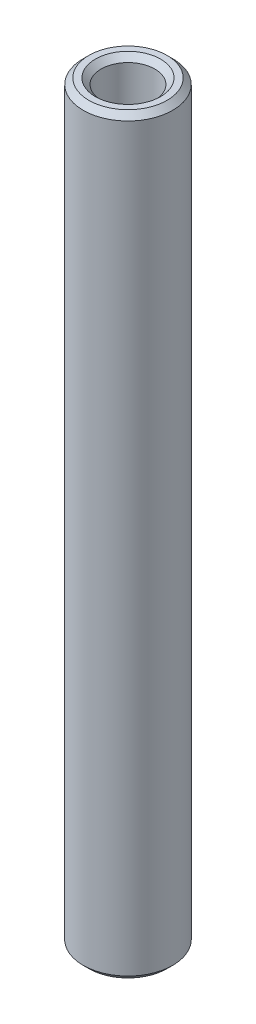
ISO-10303-21;
HEADER;
FILE_DESCRIPTION(('STEP AP214'),'2;1');
FILE_NAME('part.step','',(''),(''),'','','');
FILE_SCHEMA(('AUTOMOTIVE_DESIGN { 1 0 10303 214 1 1 1 1 }'));
ENDSEC;
DATA;
#1=APPLICATION_CONTEXT('core data for automotive mechanical design processes');
#2=APPLICATION_PROTOCOL_DEFINITION('international standard','automotive_design',2000,#1);
#3=PRODUCT_CONTEXT('',#1,'mechanical');
#4=PRODUCT('Part','Part','',(#3));
#5=PRODUCT_RELATED_PRODUCT_CATEGORY('part','',(#4));
#6=PRODUCT_DEFINITION_FORMATION('','',#4);
#7=PRODUCT_DEFINITION_CONTEXT('part definition',#1,'design');
#8=PRODUCT_DEFINITION('design','',#6,#7);
#9=PRODUCT_DEFINITION_SHAPE('','',#8);
#10=(LENGTH_UNIT() NAMED_UNIT(*) SI_UNIT(.MILLI.,.METRE.));
#11=(NAMED_UNIT(*) PLANE_ANGLE_UNIT() SI_UNIT($,.RADIAN.));
#12=(NAMED_UNIT(*) SI_UNIT($,.STERADIAN.) SOLID_ANGLE_UNIT());
#13=UNCERTAINTY_MEASURE_WITH_UNIT(LENGTH_MEASURE(1.E-05),#10,'distance_accuracy_value','');
#14=(GEOMETRIC_REPRESENTATION_CONTEXT(3) GLOBAL_UNCERTAINTY_ASSIGNED_CONTEXT((#13)) GLOBAL_UNIT_ASSIGNED_CONTEXT((#10,
#11,#12)) REPRESENTATION_CONTEXT('',''));
#15=CARTESIAN_POINT('',(0.,0.,0.));
#16=DIRECTION('',(0.,0.,1.));
#17=DIRECTION('',(1.,0.,0.));
#18=AXIS2_PLACEMENT_3D('',#15,#16,#17);
#19=CARTESIAN_POINT('',(0.,16.66875,0.));
#20=DIRECTION('',(0.,1.,0.));
#21=DIRECTION('',(0.,0.,1.));
#22=AXIS2_PLACEMENT_3D('',#19,#20,#21);
#23=PLANE('',#22);
#24=CARTESIAN_POINT('',(0.,16.66875,0.));
#25=DIRECTION('',(0.,1.,0.));
#26=DIRECTION('',(0.,0.,1.));
#27=AXIS2_PLACEMENT_3D('',#24,#25,#26);
#28=CIRCLE('',#27,1.44462499999999);
#29=CARTESIAN_POINT('',(0.,16.66875,1.44462499999999));
#30=VERTEX_POINT('',#29);
#31=EDGE_CURVE('E10',#30,#30,#28,.F.);
#32=ORIENTED_EDGE('',*,*,#31,.T.);
#33=EDGE_LOOP('',(#32));
#34=FACE_BOUND('',#33,.T.);
#35=CARTESIAN_POINT('',(0.,16.66875,0.));
#36=DIRECTION('',(0.,1.,0.));
#37=DIRECTION('',(0.,0.,1.));
#38=AXIS2_PLACEMENT_3D('',#35,#36,#37);
#39=CIRCLE('',#38,1.730375);
#40=CARTESIAN_POINT('',(0.,16.66875,1.730375));
#41=VERTEX_POINT('',#40);
#42=EDGE_CURVE('E41',#41,#41,#39,.T.);
#43=ORIENTED_EDGE('',*,*,#42,.T.);
#44=EDGE_LOOP('',(#43));
#45=FACE_BOUND('',#44,.T.);
#46=ADVANCED_FACE('F33',(#34,#45),#23,.T.);
#47=CARTESIAN_POINT('',(0.,-16.66875,0.));
#48=DIRECTION('',(0.,1.,0.));
#49=DIRECTION('',(0.,0.,1.));
#50=AXIS2_PLACEMENT_3D('',#47,#48,#49);
#51=PLANE('',#50);
#52=CARTESIAN_POINT('',(0.,-16.66875,0.));
#53=DIRECTION('',(0.,1.,0.));
#54=DIRECTION('',(0.,0.,1.));
#55=AXIS2_PLACEMENT_3D('',#52,#53,#54);
#56=CIRCLE('',#55,1.444625);
#57=CARTESIAN_POINT('',(0.,-16.66875,1.444625));
#58=VERTEX_POINT('',#57);
#59=EDGE_CURVE('E60',#58,#58,#56,.T.);
#60=ORIENTED_EDGE('',*,*,#59,.T.);
#61=EDGE_LOOP('',(#60));
#62=FACE_BOUND('',#61,.T.);
#63=CARTESIAN_POINT('',(0.,-16.66875,0.));
#64=DIRECTION('',(0.,1.,0.));
#65=DIRECTION('',(0.,0.,1.));
#66=AXIS2_PLACEMENT_3D('',#63,#64,#65);
#67=CIRCLE('',#66,1.730375);
#68=CARTESIAN_POINT('',(0.,-16.66875,1.730375));
#69=VERTEX_POINT('',#68);
#70=EDGE_CURVE('E63',#69,#69,#67,.F.);
#71=ORIENTED_EDGE('',*,*,#70,.T.);
#72=EDGE_LOOP('',(#71));
#73=FACE_BOUND('',#72,.T.);
#74=ADVANCED_FACE('F67',(#62,#73),#51,.F.);
#75=CARTESIAN_POINT('',(0.,16.66875,0.));
#76=DIRECTION('',(0.,-1.,0.));
#77=DIRECTION('',(0.,0.,-1.));
#78=AXIS2_PLACEMENT_3D('',#75,#76,#77);
#79=CYLINDRICAL_SURFACE('',#78,1.984375);
#80=CARTESIAN_POINT('',(0.,-16.41475,0.));
#81=DIRECTION('',(0.,1.,0.));
#82=DIRECTION('',(0.,0.,1.));
#83=AXIS2_PLACEMENT_3D('',#80,#81,#82);
#84=CIRCLE('',#83,1.984375);
#85=CARTESIAN_POINT('',(0.,-16.41475,1.984375));
#86=VERTEX_POINT('',#85);
#87=EDGE_CURVE('E45',#86,#86,#84,.T.);
#88=ORIENTED_EDGE('',*,*,#87,.T.);
#89=EDGE_LOOP('',(#88));
#90=FACE_BOUND('',#89,.T.);
#91=CARTESIAN_POINT('',(0.,16.41475,0.));
#92=DIRECTION('',(0.,1.,0.));
#93=DIRECTION('',(0.,0.,1.));
#94=AXIS2_PLACEMENT_3D('',#91,#92,#93);
#95=CIRCLE('',#94,1.984375);
#96=CARTESIAN_POINT('',(0.,16.41475,1.984375));
#97=VERTEX_POINT('',#96);
#98=EDGE_CURVE('E49',#97,#97,#95,.F.);
#99=ORIENTED_EDGE('',*,*,#98,.T.);
#100=EDGE_LOOP('',(#99));
#101=FACE_BOUND('',#100,.T.);
#102=ADVANCED_FACE('F77',(#90,#101),#79,.T.);
#103=CARTESIAN_POINT('',(0.,16.66875,0.));
#104=DIRECTION('',(0.,-1.,0.));
#105=DIRECTION('',(0.,0.,-1.));
#106=AXIS2_PLACEMENT_3D('',#103,#104,#105);
#107=CYLINDRICAL_SURFACE('',#106,1.190625);
#108=CARTESIAN_POINT('',(0.,-16.41475,0.));
#109=DIRECTION('',(0.,1.,0.));
#110=DIRECTION('',(0.,0.,1.));
#111=AXIS2_PLACEMENT_3D('',#108,#109,#110);
#112=CIRCLE('',#111,1.190625);
#113=CARTESIAN_POINT('',(0.,-16.41475,1.190625));
#114=VERTEX_POINT('',#113);
#115=EDGE_CURVE('E54',#114,#114,#112,.F.);
#116=ORIENTED_EDGE('',*,*,#115,.T.);
#117=EDGE_LOOP('',(#116));
#118=FACE_BOUND('',#117,.T.);
#119=CARTESIAN_POINT('',(0.,16.41475,0.));
#120=DIRECTION('',(0.,1.,0.));
#121=DIRECTION('',(0.,0.,1.));
#122=AXIS2_PLACEMENT_3D('',#119,#120,#121);
#123=CIRCLE('',#122,1.190625);
#124=CARTESIAN_POINT('',(0.,16.41475,1.190625));
#125=VERTEX_POINT('',#124);
#126=EDGE_CURVE('E57',#125,#125,#123,.T.);
#127=ORIENTED_EDGE('',*,*,#126,.T.);
#128=EDGE_LOOP('',(#127));
#129=FACE_BOUND('',#128,.T.);
#130=ADVANCED_FACE('F80',(#118,#129),#107,.F.);
#131=CARTESIAN_POINT('',(0.,-16.66875,0.));
#132=DIRECTION('',(0.,-1.,0.));
#133=DIRECTION('',(0.,0.,-1.));
#134=AXIS2_PLACEMENT_3D('',#131,#132,#133);
#135=CONICAL_SURFACE('',#134,1.444625,0.785398163397456);
#136=ORIENTED_EDGE('',*,*,#115,.F.);
#137=EDGE_LOOP('',(#136));
#138=FACE_BOUND('',#137,.T.);
#139=ORIENTED_EDGE('',*,*,#59,.F.);
#140=EDGE_LOOP('',(#139));
#141=FACE_BOUND('',#140,.T.);
#142=ADVANCED_FACE('F73',(#138,#141),#135,.F.);
#143=CARTESIAN_POINT('',(0.,-16.41475,0.));
#144=DIRECTION('',(0.,1.,0.));
#145=DIRECTION('',(0.,0.,1.));
#146=AXIS2_PLACEMENT_3D('',#143,#144,#145);
#147=CONICAL_SURFACE('',#146,1.984375,0.785398163397442);
#148=ORIENTED_EDGE('',*,*,#70,.F.);
#149=EDGE_LOOP('',(#148));
#150=FACE_BOUND('',#149,.T.);
#151=ORIENTED_EDGE('',*,*,#87,.F.);
#152=EDGE_LOOP('',(#151));
#153=FACE_BOUND('',#152,.T.);
#154=ADVANCED_FACE('F69',(#150,#153),#147,.T.);
#155=CARTESIAN_POINT('',(0.,16.41475,0.));
#156=DIRECTION('',(0.,1.,0.));
#157=DIRECTION('',(0.,0.,1.));
#158=AXIS2_PLACEMENT_3D('',#155,#156,#157);
#159=CONICAL_SURFACE('',#158,1.190625,0.785398163397443);
#160=ORIENTED_EDGE('',*,*,#31,.F.);
#161=EDGE_LOOP('',(#160));
#162=FACE_BOUND('',#161,.T.);
#163=ORIENTED_EDGE('',*,*,#126,.F.);
#164=EDGE_LOOP('',(#163));
#165=FACE_BOUND('',#164,.T.);
#166=ADVANCED_FACE('F72',(#162,#165),#159,.F.);
#167=CARTESIAN_POINT('',(0.,16.66875,0.));
#168=DIRECTION('',(0.,-1.,0.));
#169=DIRECTION('',(0.,0.,-1.));
#170=AXIS2_PLACEMENT_3D('',#167,#168,#169);
#171=CONICAL_SURFACE('',#170,1.730375,0.785398163397448);
#172=ORIENTED_EDGE('',*,*,#98,.F.);
#173=EDGE_LOOP('',(#172));
#174=FACE_BOUND('',#173,.T.);
#175=ORIENTED_EDGE('',*,*,#42,.F.);
#176=EDGE_LOOP('',(#175));
#177=FACE_BOUND('',#176,.T.);
#178=ADVANCED_FACE('F36',(#174,#177),#171,.T.);
#179=CLOSED_SHELL('',(#46,#74,#102,#130,#142,#154,#166,#178));
#180=MANIFOLD_SOLID_BREP('B2',#179);
#181=ADVANCED_BREP_SHAPE_REPRESENTATION('',(#18,#180),#14);
#182=SHAPE_DEFINITION_REPRESENTATION(#9,#181);
ENDSEC;
END-ISO-10303-21;
